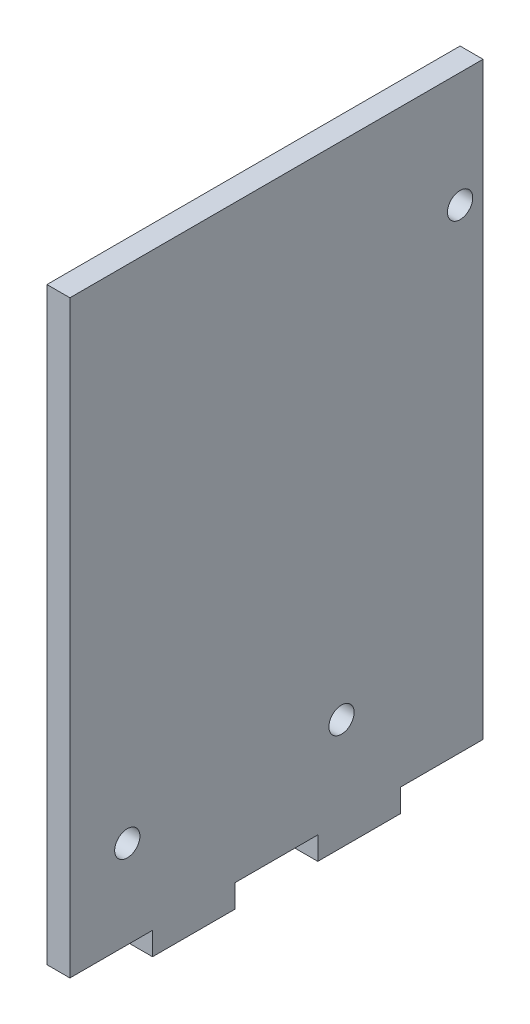
ISO-10303-21;
HEADER;
FILE_DESCRIPTION(('STEP AP214'),'2;1');
FILE_NAME('part.step','',(''),(''),'','','');
FILE_SCHEMA(('AUTOMOTIVE_DESIGN { 1 0 10303 214 1 1 1 1 }'));
ENDSEC;
DATA;
#1=APPLICATION_CONTEXT('core data for automotive mechanical design processes');
#2=APPLICATION_PROTOCOL_DEFINITION('international standard','automotive_design',2000,#1);
#3=PRODUCT_CONTEXT('',#1,'mechanical');
#4=PRODUCT('Part','Part','',(#3));
#5=PRODUCT_RELATED_PRODUCT_CATEGORY('part','',(#4));
#6=PRODUCT_DEFINITION_FORMATION('','',#4);
#7=PRODUCT_DEFINITION_CONTEXT('part definition',#1,'design');
#8=PRODUCT_DEFINITION('design','',#6,#7);
#9=PRODUCT_DEFINITION_SHAPE('','',#8);
#10=(LENGTH_UNIT() NAMED_UNIT(*) SI_UNIT(.MILLI.,.METRE.));
#11=(NAMED_UNIT(*) PLANE_ANGLE_UNIT() SI_UNIT($,.RADIAN.));
#12=(NAMED_UNIT(*) SI_UNIT($,.STERADIAN.) SOLID_ANGLE_UNIT());
#13=UNCERTAINTY_MEASURE_WITH_UNIT(LENGTH_MEASURE(1.E-05),#10,'distance_accuracy_value','');
#14=(GEOMETRIC_REPRESENTATION_CONTEXT(3) GLOBAL_UNCERTAINTY_ASSIGNED_CONTEXT((#13)) GLOBAL_UNIT_ASSIGNED_CONTEXT((#10,
#11,#12)) REPRESENTATION_CONTEXT('',''));
#15=CARTESIAN_POINT('',(0.,0.,0.));
#16=DIRECTION('',(0.,0.,1.));
#17=DIRECTION('',(1.,0.,0.));
#18=AXIS2_PLACEMENT_3D('',#15,#16,#17);
#19=CARTESIAN_POINT('',(3.,40.,0.));
#20=DIRECTION('',(0.,1.,0.));
#21=DIRECTION('',(0.,0.,1.));
#22=AXIS2_PLACEMENT_3D('',#19,#20,#21);
#23=PLANE('',#22);
#24=DIRECTION('',(0.,0.,-1.));
#25=VECTOR('',#24,1.);
#26=CARTESIAN_POINT('',(0.,40.,0.));
#27=LINE('',#26,#25);
#28=CARTESIAN_POINT('',(0.,40.,27.));
#29=VERTEX_POINT('',#28);
#30=CARTESIAN_POINT('',(0.,40.,-27.));
#31=VERTEX_POINT('',#30);
#32=EDGE_CURVE('E190',#29,#31,#27,.T.);
#33=ORIENTED_EDGE('',*,*,#32,.F.);
#34=DIRECTION('',(-1.,0.,0.));
#35=VECTOR('',#34,1.);
#36=CARTESIAN_POINT('',(3.,40.,27.));
#37=LINE('',#36,#35);
#38=CARTESIAN_POINT('',(3.,40.,27.));
#39=VERTEX_POINT('',#38);
#40=EDGE_CURVE('E11',#39,#29,#37,.T.);
#41=ORIENTED_EDGE('',*,*,#40,.F.);
#42=DIRECTION('',(0.,0.,-1.));
#43=VECTOR('',#42,1.);
#44=CARTESIAN_POINT('',(3.,40.,0.));
#45=LINE('',#44,#43);
#46=CARTESIAN_POINT('',(3.,40.,-27.));
#47=VERTEX_POINT('',#46);
#48=EDGE_CURVE('E294',#39,#47,#45,.T.);
#49=ORIENTED_EDGE('',*,*,#48,.T.);
#50=DIRECTION('',(-1.,0.,0.));
#51=VECTOR('',#50,1.);
#52=CARTESIAN_POINT('',(3.,40.,-27.));
#53=LINE('',#52,#51);
#54=EDGE_CURVE('E98',#47,#31,#53,.T.);
#55=ORIENTED_EDGE('',*,*,#54,.T.);
#56=EDGE_LOOP('',(#33,#41,#49,#55));
#57=FACE_BOUND('',#56,.T.);
#58=ADVANCED_FACE('F35',(#57),#23,.T.);
#59=CARTESIAN_POINT('',(3.,0.,27.));
#60=DIRECTION('',(0.,0.,1.));
#61=DIRECTION('',(1.,0.,0.));
#62=AXIS2_PLACEMENT_3D('',#59,#60,#61);
#63=PLANE('',#62);
#64=DIRECTION('',(0.,1.,0.));
#65=VECTOR('',#64,1.);
#66=CARTESIAN_POINT('',(0.,0.,27.));
#67=LINE('',#66,#65);
#68=CARTESIAN_POINT('',(0.,-37.,27.));
#69=VERTEX_POINT('',#68);
#70=EDGE_CURVE('E184',#69,#29,#67,.T.);
#71=ORIENTED_EDGE('',*,*,#70,.F.);
#72=DIRECTION('',(-1.,0.,0.));
#73=VECTOR('',#72,1.);
#74=CARTESIAN_POINT('',(3.,-37.,27.));
#75=LINE('',#74,#73);
#76=CARTESIAN_POINT('',(3.,-37.,27.));
#77=VERTEX_POINT('',#76);
#78=EDGE_CURVE('E44',#77,#69,#75,.T.);
#79=ORIENTED_EDGE('',*,*,#78,.F.);
#80=DIRECTION('',(0.,1.,0.));
#81=VECTOR('',#80,1.);
#82=CARTESIAN_POINT('',(3.,0.,27.));
#83=LINE('',#82,#81);
#84=EDGE_CURVE('E296',#77,#39,#83,.T.);
#85=ORIENTED_EDGE('',*,*,#84,.T.);
#86=ORIENTED_EDGE('',*,*,#40,.T.);
#87=EDGE_LOOP('',(#71,#79,#85,#86));
#88=FACE_BOUND('',#87,.T.);
#89=ADVANCED_FACE('F189',(#88),#63,.T.);
#90=CARTESIAN_POINT('',(3.,-37.,0.));
#91=DIRECTION('',(0.,1.,0.));
#92=DIRECTION('',(0.,0.,1.));
#93=AXIS2_PLACEMENT_3D('',#90,#91,#92);
#94=PLANE('',#93);
#95=DIRECTION('',(0.,0.,-1.));
#96=VECTOR('',#95,1.);
#97=CARTESIAN_POINT('',(0.,-37.,0.));
#98=LINE('',#97,#96);
#99=CARTESIAN_POINT('',(0.,-37.,16.2));
#100=VERTEX_POINT('',#99);
#101=EDGE_CURVE('E175',#69,#100,#98,.T.);
#102=ORIENTED_EDGE('',*,*,#101,.T.);
#103=DIRECTION('',(-1.,0.,0.));
#104=VECTOR('',#103,1.);
#105=CARTESIAN_POINT('',(3.,-37.,16.2));
#106=LINE('',#105,#104);
#107=CARTESIAN_POINT('',(3.,-37.,16.2));
#108=VERTEX_POINT('',#107);
#109=EDGE_CURVE('E168',#108,#100,#106,.T.);
#110=ORIENTED_EDGE('',*,*,#109,.F.);
#111=DIRECTION('',(0.,0.,-1.));
#112=VECTOR('',#111,1.);
#113=CARTESIAN_POINT('',(3.,-37.,0.));
#114=LINE('',#113,#112);
#115=EDGE_CURVE('E177',#77,#108,#114,.T.);
#116=ORIENTED_EDGE('',*,*,#115,.F.);
#117=ORIENTED_EDGE('',*,*,#78,.T.);
#118=EDGE_LOOP('',(#102,#110,#116,#117));
#119=FACE_BOUND('',#118,.T.);
#120=ADVANCED_FACE('F173',(#119),#94,.F.);
#121=CARTESIAN_POINT('',(3.,0.,16.2));
#122=DIRECTION('',(0.,0.,1.));
#123=DIRECTION('',(1.,0.,0.));
#124=AXIS2_PLACEMENT_3D('',#121,#122,#123);
#125=PLANE('',#124);
#126=DIRECTION('',(0.,1.,0.));
#127=VECTOR('',#126,1.);
#128=CARTESIAN_POINT('',(0.,0.,16.2));
#129=LINE('',#128,#127);
#130=CARTESIAN_POINT('',(0.,-40.,16.2));
#131=VERTEX_POINT('',#130);
#132=EDGE_CURVE('E187',#131,#100,#129,.T.);
#133=ORIENTED_EDGE('',*,*,#132,.F.);
#134=DIRECTION('',(-1.,0.,0.));
#135=VECTOR('',#134,1.);
#136=CARTESIAN_POINT('',(3.,-40.,16.2));
#137=LINE('',#136,#135);
#138=CARTESIAN_POINT('',(3.,-40.,16.2));
#139=VERTEX_POINT('',#138);
#140=EDGE_CURVE('E166',#139,#131,#137,.T.);
#141=ORIENTED_EDGE('',*,*,#140,.F.);
#142=DIRECTION('',(0.,1.,0.));
#143=VECTOR('',#142,1.);
#144=CARTESIAN_POINT('',(3.,0.,16.2));
#145=LINE('',#144,#143);
#146=EDGE_CURVE('E303',#139,#108,#145,.T.);
#147=ORIENTED_EDGE('',*,*,#146,.T.);
#148=ORIENTED_EDGE('',*,*,#109,.T.);
#149=EDGE_LOOP('',(#133,#141,#147,#148));
#150=FACE_BOUND('',#149,.T.);
#151=ADVANCED_FACE('F248',(#150),#125,.T.);
#152=CARTESIAN_POINT('',(3.,-40.,0.));
#153=DIRECTION('',(0.,1.,0.));
#154=DIRECTION('',(0.,0.,1.));
#155=AXIS2_PLACEMENT_3D('',#152,#153,#154);
#156=PLANE('',#155);
#157=DIRECTION('',(0.,0.,-1.));
#158=VECTOR('',#157,1.);
#159=CARTESIAN_POINT('',(0.,-40.,0.));
#160=LINE('',#159,#158);
#161=CARTESIAN_POINT('',(0.,-40.,5.4));
#162=VERTEX_POINT('',#161);
#163=EDGE_CURVE('E197',#131,#162,#160,.T.);
#164=ORIENTED_EDGE('',*,*,#163,.T.);
#165=DIRECTION('',(-1.,0.,0.));
#166=VECTOR('',#165,1.);
#167=CARTESIAN_POINT('',(3.,-40.,5.4));
#168=LINE('',#167,#166);
#169=CARTESIAN_POINT('',(3.,-40.,5.4));
#170=VERTEX_POINT('',#169);
#171=EDGE_CURVE('E163',#170,#162,#168,.T.);
#172=ORIENTED_EDGE('',*,*,#171,.F.);
#173=DIRECTION('',(0.,0.,-1.));
#174=VECTOR('',#173,1.);
#175=CARTESIAN_POINT('',(3.,-40.,0.));
#176=LINE('',#175,#174);
#177=EDGE_CURVE('E306',#139,#170,#176,.T.);
#178=ORIENTED_EDGE('',*,*,#177,.F.);
#179=ORIENTED_EDGE('',*,*,#140,.T.);
#180=EDGE_LOOP('',(#164,#172,#178,#179));
#181=FACE_BOUND('',#180,.T.);
#182=ADVANCED_FACE('F251',(#181),#156,.F.);
#183=CARTESIAN_POINT('',(3.,0.,5.4));
#184=DIRECTION('',(0.,0.,1.));
#185=DIRECTION('',(1.,0.,0.));
#186=AXIS2_PLACEMENT_3D('',#183,#184,#185);
#187=PLANE('',#186);
#188=DIRECTION('',(0.,1.,0.));
#189=VECTOR('',#188,1.);
#190=CARTESIAN_POINT('',(0.,0.,5.4));
#191=LINE('',#190,#189);
#192=CARTESIAN_POINT('',(0.,-37.,5.4));
#193=VERTEX_POINT('',#192);
#194=EDGE_CURVE('E200',#162,#193,#191,.T.);
#195=ORIENTED_EDGE('',*,*,#194,.T.);
#196=DIRECTION('',(-1.,0.,0.));
#197=VECTOR('',#196,1.);
#198=CARTESIAN_POINT('',(3.,-37.,5.4));
#199=LINE('',#198,#197);
#200=CARTESIAN_POINT('',(3.,-37.,5.4));
#201=VERTEX_POINT('',#200);
#202=EDGE_CURVE('E160',#201,#193,#199,.T.);
#203=ORIENTED_EDGE('',*,*,#202,.F.);
#204=DIRECTION('',(0.,1.,0.));
#205=VECTOR('',#204,1.);
#206=CARTESIAN_POINT('',(3.,0.,5.4));
#207=LINE('',#206,#205);
#208=EDGE_CURVE('E309',#170,#201,#207,.T.);
#209=ORIENTED_EDGE('',*,*,#208,.F.);
#210=ORIENTED_EDGE('',*,*,#171,.T.);
#211=EDGE_LOOP('',(#195,#203,#209,#210));
#212=FACE_BOUND('',#211,.T.);
#213=ADVANCED_FACE('F255',(#212),#187,.F.);
#214=CARTESIAN_POINT('',(3.,-37.,0.));
#215=DIRECTION('',(0.,1.,0.));
#216=DIRECTION('',(0.,0.,1.));
#217=AXIS2_PLACEMENT_3D('',#214,#215,#216);
#218=PLANE('',#217);
#219=DIRECTION('',(0.,0.,-1.));
#220=VECTOR('',#219,1.);
#221=CARTESIAN_POINT('',(0.,-37.,0.));
#222=LINE('',#221,#220);
#223=CARTESIAN_POINT('',(0.,-37.,-5.4));
#224=VERTEX_POINT('',#223);
#225=EDGE_CURVE('E203',#193,#224,#222,.T.);
#226=ORIENTED_EDGE('',*,*,#225,.T.);
#227=DIRECTION('',(-1.,0.,0.));
#228=VECTOR('',#227,1.);
#229=CARTESIAN_POINT('',(3.,-37.,-5.4));
#230=LINE('',#229,#228);
#231=CARTESIAN_POINT('',(3.,-37.,-5.4));
#232=VERTEX_POINT('',#231);
#233=EDGE_CURVE('E158',#232,#224,#230,.T.);
#234=ORIENTED_EDGE('',*,*,#233,.F.);
#235=DIRECTION('',(0.,0.,-1.));
#236=VECTOR('',#235,1.);
#237=CARTESIAN_POINT('',(3.,-37.,0.));
#238=LINE('',#237,#236);
#239=EDGE_CURVE('E312',#201,#232,#238,.T.);
#240=ORIENTED_EDGE('',*,*,#239,.F.);
#241=ORIENTED_EDGE('',*,*,#202,.T.);
#242=EDGE_LOOP('',(#226,#234,#240,#241));
#243=FACE_BOUND('',#242,.T.);
#244=ADVANCED_FACE('F259',(#243),#218,.F.);
#245=CARTESIAN_POINT('',(3.,0.,-5.39999999999998));
#246=DIRECTION('',(0.,0.,1.));
#247=DIRECTION('',(0.,-1.,0.));
#248=AXIS2_PLACEMENT_3D('',#245,#246,#247);
#249=PLANE('',#248);
#250=DIRECTION('',(0.,1.,0.));
#251=VECTOR('',#250,1.);
#252=CARTESIAN_POINT('',(0.,0.,-5.39999999999998));
#253=LINE('',#252,#251);
#254=CARTESIAN_POINT('',(0.,-40.,-5.40000000000001));
#255=VERTEX_POINT('',#254);
#256=EDGE_CURVE('E206',#255,#224,#253,.T.);
#257=ORIENTED_EDGE('',*,*,#256,.F.);
#258=DIRECTION('',(-1.,0.,0.));
#259=VECTOR('',#258,1.);
#260=CARTESIAN_POINT('',(3.,-40.,-5.40000000000001));
#261=LINE('',#260,#259);
#262=CARTESIAN_POINT('',(3.,-40.,-5.40000000000001));
#263=VERTEX_POINT('',#262);
#264=EDGE_CURVE('E152',#263,#255,#261,.T.);
#265=ORIENTED_EDGE('',*,*,#264,.F.);
#266=DIRECTION('',(0.,1.,0.));
#267=VECTOR('',#266,1.);
#268=CARTESIAN_POINT('',(3.,0.,-5.39999999999998));
#269=LINE('',#268,#267);
#270=EDGE_CURVE('E314',#263,#232,#269,.T.);
#271=ORIENTED_EDGE('',*,*,#270,.T.);
#272=ORIENTED_EDGE('',*,*,#233,.T.);
#273=EDGE_LOOP('',(#257,#265,#271,#272));
#274=FACE_BOUND('',#273,.T.);
#275=ADVANCED_FACE('F263',(#274),#249,.T.);
#276=CARTESIAN_POINT('',(3.,-40.,0.));
#277=DIRECTION('',(0.,-1.,0.));
#278=DIRECTION('',(0.,0.,-1.));
#279=AXIS2_PLACEMENT_3D('',#276,#277,#278);
#280=PLANE('',#279);
#281=DIRECTION('',(0.,0.,1.));
#282=VECTOR('',#281,1.);
#283=CARTESIAN_POINT('',(0.,-40.,0.));
#284=LINE('',#283,#282);
#285=CARTESIAN_POINT('',(0.,-40.,-16.2));
#286=VERTEX_POINT('',#285);
#287=EDGE_CURVE('E209',#286,#255,#284,.T.);
#288=ORIENTED_EDGE('',*,*,#287,.F.);
#289=DIRECTION('',(-1.,0.,0.));
#290=VECTOR('',#289,1.);
#291=CARTESIAN_POINT('',(3.,-40.,-16.2));
#292=LINE('',#291,#290);
#293=CARTESIAN_POINT('',(3.,-40.,-16.2));
#294=VERTEX_POINT('',#293);
#295=EDGE_CURVE('E150',#294,#286,#292,.T.);
#296=ORIENTED_EDGE('',*,*,#295,.F.);
#297=DIRECTION('',(0.,0.,1.));
#298=VECTOR('',#297,1.);
#299=CARTESIAN_POINT('',(3.,-40.,0.));
#300=LINE('',#299,#298);
#301=EDGE_CURVE('E144',#294,#263,#300,.T.);
#302=ORIENTED_EDGE('',*,*,#301,.T.);
#303=ORIENTED_EDGE('',*,*,#264,.T.);
#304=EDGE_LOOP('',(#288,#296,#302,#303));
#305=FACE_BOUND('',#304,.T.);
#306=ADVANCED_FACE('F267',(#305),#280,.T.);
#307=CARTESIAN_POINT('',(3.,0.,-16.2));
#308=DIRECTION('',(0.,0.,1.));
#309=DIRECTION('',(1.,0.,0.));
#310=AXIS2_PLACEMENT_3D('',#307,#308,#309);
#311=PLANE('',#310);
#312=DIRECTION('',(0.,1.,0.));
#313=VECTOR('',#312,1.);
#314=CARTESIAN_POINT('',(0.,0.,-16.2));
#315=LINE('',#314,#313);
#316=CARTESIAN_POINT('',(0.,-37.,-16.2));
#317=VERTEX_POINT('',#316);
#318=EDGE_CURVE('E149',#286,#317,#315,.T.);
#319=ORIENTED_EDGE('',*,*,#318,.T.);
#320=DIRECTION('',(-1.,0.,0.));
#321=VECTOR('',#320,1.);
#322=CARTESIAN_POINT('',(3.,-37.,-16.2));
#323=LINE('',#322,#321);
#324=CARTESIAN_POINT('',(3.,-37.,-16.2));
#325=VERTEX_POINT('',#324);
#326=EDGE_CURVE('E134',#325,#317,#323,.T.);
#327=ORIENTED_EDGE('',*,*,#326,.F.);
#328=DIRECTION('',(0.,1.,0.));
#329=VECTOR('',#328,1.);
#330=CARTESIAN_POINT('',(3.,0.,-16.2));
#331=LINE('',#330,#329);
#332=EDGE_CURVE('E137',#294,#325,#331,.T.);
#333=ORIENTED_EDGE('',*,*,#332,.F.);
#334=ORIENTED_EDGE('',*,*,#295,.T.);
#335=EDGE_LOOP('',(#319,#327,#333,#334));
#336=FACE_BOUND('',#335,.T.);
#337=ADVANCED_FACE('F147',(#336),#311,.F.);
#338=CARTESIAN_POINT('',(3.,-37.,0.));
#339=DIRECTION('',(0.,1.,0.));
#340=DIRECTION('',(0.,0.,1.));
#341=AXIS2_PLACEMENT_3D('',#338,#339,#340);
#342=PLANE('',#341);
#343=DIRECTION('',(0.,0.,-1.));
#344=VECTOR('',#343,1.);
#345=CARTESIAN_POINT('',(0.,-37.,0.));
#346=LINE('',#345,#344);
#347=CARTESIAN_POINT('',(0.,-37.,-27.));
#348=VERTEX_POINT('',#347);
#349=EDGE_CURVE('E213',#317,#348,#346,.T.);
#350=ORIENTED_EDGE('',*,*,#349,.T.);
#351=DIRECTION('',(-1.,0.,0.));
#352=VECTOR('',#351,1.);
#353=CARTESIAN_POINT('',(3.,-37.,-27.));
#354=LINE('',#353,#352);
#355=CARTESIAN_POINT('',(3.,-37.,-27.));
#356=VERTEX_POINT('',#355);
#357=EDGE_CURVE('E136',#356,#348,#354,.T.);
#358=ORIENTED_EDGE('',*,*,#357,.F.);
#359=DIRECTION('',(0.,0.,-1.));
#360=VECTOR('',#359,1.);
#361=CARTESIAN_POINT('',(3.,-37.,0.));
#362=LINE('',#361,#360);
#363=EDGE_CURVE('E129',#325,#356,#362,.T.);
#364=ORIENTED_EDGE('',*,*,#363,.F.);
#365=ORIENTED_EDGE('',*,*,#326,.T.);
#366=EDGE_LOOP('',(#350,#358,#364,#365));
#367=FACE_BOUND('',#366,.T.);
#368=ADVANCED_FACE('F132',(#367),#342,.F.);
#369=CARTESIAN_POINT('',(3.,25.,-24.));
#370=DIRECTION('',(-1.,0.,0.));
#371=DIRECTION('',(0.,0.,1.));
#372=AXIS2_PLACEMENT_3D('',#369,#370,#371);
#373=CYLINDRICAL_SURFACE('',#372,1.65);
#374=CARTESIAN_POINT('',(3.,25.,-24.));
#375=DIRECTION('',(1.,0.,0.));
#376=DIRECTION('',(0.,0.,-1.));
#377=AXIS2_PLACEMENT_3D('',#374,#375,#376);
#378=CIRCLE('',#377,1.65);
#379=CARTESIAN_POINT('',(3.,25.,-25.65));
#380=VERTEX_POINT('',#379);
#381=EDGE_CURVE('E293',#380,#380,#378,.T.);
#382=ORIENTED_EDGE('',*,*,#381,.T.);
#383=EDGE_LOOP('',(#382));
#384=FACE_BOUND('',#383,.T.);
#385=CARTESIAN_POINT('',(0.,25.,-24.));
#386=DIRECTION('',(1.,0.,0.));
#387=DIRECTION('',(0.,0.,-1.));
#388=AXIS2_PLACEMENT_3D('',#385,#386,#387);
#389=CIRCLE('',#388,1.65);
#390=CARTESIAN_POINT('',(0.,25.,-25.65));
#391=VERTEX_POINT('',#390);
#392=EDGE_CURVE('E192',#391,#391,#389,.T.);
#393=ORIENTED_EDGE('',*,*,#392,.F.);
#394=EDGE_LOOP('',(#393));
#395=FACE_BOUND('',#394,.T.);
#396=ADVANCED_FACE('F227',(#384,#395),#373,.F.);
#397=CARTESIAN_POINT('',(3.,-25.5,19.5));
#398=DIRECTION('',(-1.,0.,0.));
#399=DIRECTION('',(0.,0.,1.));
#400=AXIS2_PLACEMENT_3D('',#397,#398,#399);
#401=CYLINDRICAL_SURFACE('',#400,1.65);
#402=CARTESIAN_POINT('',(3.,-25.5,19.5));
#403=DIRECTION('',(1.,0.,0.));
#404=DIRECTION('',(0.,0.,-1.));
#405=AXIS2_PLACEMENT_3D('',#402,#403,#404);
#406=CIRCLE('',#405,1.65);
#407=CARTESIAN_POINT('',(3.,-25.5,17.85));
#408=VERTEX_POINT('',#407);
#409=EDGE_CURVE('E291',#408,#408,#406,.T.);
#410=ORIENTED_EDGE('',*,*,#409,.T.);
#411=EDGE_LOOP('',(#410));
#412=FACE_BOUND('',#411,.T.);
#413=CARTESIAN_POINT('',(0.,-25.5,19.5));
#414=DIRECTION('',(1.,0.,0.));
#415=DIRECTION('',(0.,0.,-1.));
#416=AXIS2_PLACEMENT_3D('',#413,#414,#415);
#417=CIRCLE('',#416,1.65);
#418=CARTESIAN_POINT('',(0.,-25.5,17.85));
#419=VERTEX_POINT('',#418);
#420=EDGE_CURVE('E221',#419,#419,#417,.T.);
#421=ORIENTED_EDGE('',*,*,#420,.F.);
#422=EDGE_LOOP('',(#421));
#423=FACE_BOUND('',#422,.T.);
#424=ADVANCED_FACE('F229',(#412,#423),#401,.F.);
#425=CARTESIAN_POINT('',(3.,-25.5,-8.49999999999999));
#426=DIRECTION('',(-1.,0.,0.));
#427=DIRECTION('',(0.,0.,1.));
#428=AXIS2_PLACEMENT_3D('',#425,#426,#427);
#429=CYLINDRICAL_SURFACE('',#428,1.65);
#430=CARTESIAN_POINT('',(3.,-25.5,-8.49999999999999));
#431=DIRECTION('',(1.,0.,0.));
#432=DIRECTION('',(0.,0.,-1.));
#433=AXIS2_PLACEMENT_3D('',#430,#431,#432);
#434=CIRCLE('',#433,1.65);
#435=CARTESIAN_POINT('',(3.,-25.5,-10.15));
#436=VERTEX_POINT('',#435);
#437=EDGE_CURVE('E215',#436,#436,#434,.T.);
#438=ORIENTED_EDGE('',*,*,#437,.T.);
#439=EDGE_LOOP('',(#438));
#440=FACE_BOUND('',#439,.T.);
#441=CARTESIAN_POINT('',(0.,-25.5,-8.49999999999999));
#442=DIRECTION('',(1.,0.,0.));
#443=DIRECTION('',(0.,0.,-1.));
#444=AXIS2_PLACEMENT_3D('',#441,#442,#443);
#445=CIRCLE('',#444,1.65);
#446=CARTESIAN_POINT('',(0.,-25.5,-10.15));
#447=VERTEX_POINT('',#446);
#448=EDGE_CURVE('E218',#447,#447,#445,.T.);
#449=ORIENTED_EDGE('',*,*,#448,.F.);
#450=EDGE_LOOP('',(#449));
#451=FACE_BOUND('',#450,.T.);
#452=ADVANCED_FACE('F37',(#440,#451),#429,.F.);
#453=CARTESIAN_POINT('',(3.,0.,-27.));
#454=DIRECTION('',(0.,0.,1.));
#455=DIRECTION('',(0.,-1.,0.));
#456=AXIS2_PLACEMENT_3D('',#453,#454,#455);
#457=PLANE('',#456);
#458=DIRECTION('',(0.,1.,0.));
#459=VECTOR('',#458,1.);
#460=CARTESIAN_POINT('',(0.,0.,-27.));
#461=LINE('',#460,#459);
#462=EDGE_CURVE('E91',#348,#31,#461,.T.);
#463=ORIENTED_EDGE('',*,*,#462,.T.);
#464=ORIENTED_EDGE('',*,*,#54,.F.);
#465=DIRECTION('',(0.,1.,0.));
#466=VECTOR('',#465,1.);
#467=CARTESIAN_POINT('',(3.,0.,-27.));
#468=LINE('',#467,#466);
#469=EDGE_CURVE('E52',#356,#47,#468,.T.);
#470=ORIENTED_EDGE('',*,*,#469,.F.);
#471=ORIENTED_EDGE('',*,*,#357,.T.);
#472=EDGE_LOOP('',(#463,#464,#470,#471));
#473=FACE_BOUND('',#472,.T.);
#474=ADVANCED_FACE('F274',(#473),#457,.F.);
#475=CARTESIAN_POINT('',(3.,0.,0.));
#476=DIRECTION('',(1.,0.,0.));
#477=DIRECTION('',(0.,0.,-1.));
#478=AXIS2_PLACEMENT_3D('',#475,#476,#477);
#479=PLANE('',#478);
#480=ORIENTED_EDGE('',*,*,#437,.F.);
#481=EDGE_LOOP('',(#480));
#482=FACE_BOUND('',#481,.T.);
#483=ORIENTED_EDGE('',*,*,#409,.F.);
#484=EDGE_LOOP('',(#483));
#485=FACE_BOUND('',#484,.T.);
#486=ORIENTED_EDGE('',*,*,#381,.F.);
#487=EDGE_LOOP('',(#486));
#488=FACE_BOUND('',#487,.T.);
#489=ORIENTED_EDGE('',*,*,#48,.F.);
#490=ORIENTED_EDGE('',*,*,#84,.F.);
#491=ORIENTED_EDGE('',*,*,#115,.T.);
#492=ORIENTED_EDGE('',*,*,#146,.F.);
#493=ORIENTED_EDGE('',*,*,#177,.T.);
#494=ORIENTED_EDGE('',*,*,#208,.T.);
#495=ORIENTED_EDGE('',*,*,#239,.T.);
#496=ORIENTED_EDGE('',*,*,#270,.F.);
#497=ORIENTED_EDGE('',*,*,#301,.F.);
#498=ORIENTED_EDGE('',*,*,#332,.T.);
#499=ORIENTED_EDGE('',*,*,#363,.T.);
#500=ORIENTED_EDGE('',*,*,#469,.T.);
#501=EDGE_LOOP('',(#489,#490,#491,#492,#493,#494,#495,#496,#497,#498,#499,#500));
#502=FACE_BOUND('',#501,.T.);
#503=ADVANCED_FACE('F141',(#482,#485,#488,#502),#479,.T.);
#504=CARTESIAN_POINT('',(0.,0.,0.));
#505=DIRECTION('',(1.,0.,0.));
#506=DIRECTION('',(0.,0.,-1.));
#507=AXIS2_PLACEMENT_3D('',#504,#505,#506);
#508=PLANE('',#507);
#509=ORIENTED_EDGE('',*,*,#448,.T.);
#510=EDGE_LOOP('',(#509));
#511=FACE_BOUND('',#510,.T.);
#512=ORIENTED_EDGE('',*,*,#420,.T.);
#513=EDGE_LOOP('',(#512));
#514=FACE_BOUND('',#513,.T.);
#515=ORIENTED_EDGE('',*,*,#392,.T.);
#516=EDGE_LOOP('',(#515));
#517=FACE_BOUND('',#516,.T.);
#518=ORIENTED_EDGE('',*,*,#32,.T.);
#519=ORIENTED_EDGE('',*,*,#462,.F.);
#520=ORIENTED_EDGE('',*,*,#349,.F.);
#521=ORIENTED_EDGE('',*,*,#318,.F.);
#522=ORIENTED_EDGE('',*,*,#287,.T.);
#523=ORIENTED_EDGE('',*,*,#256,.T.);
#524=ORIENTED_EDGE('',*,*,#225,.F.);
#525=ORIENTED_EDGE('',*,*,#194,.F.);
#526=ORIENTED_EDGE('',*,*,#163,.F.);
#527=ORIENTED_EDGE('',*,*,#132,.T.);
#528=ORIENTED_EDGE('',*,*,#101,.F.);
#529=ORIENTED_EDGE('',*,*,#70,.T.);
#530=EDGE_LOOP('',(#518,#519,#520,#521,#522,#523,#524,#525,#526,#527,#528,#529));
#531=FACE_BOUND('',#530,.T.);
#532=ADVANCED_FACE('F183',(#511,#514,#517,#531),#508,.F.);
#533=CLOSED_SHELL('',(#58,#89,#120,#151,#182,#213,#244,#275,#306,#337,#368,#396,#424,#452,#474,
#503,#532));
#534=MANIFOLD_SOLID_BREP('B2',#533);
#535=ADVANCED_BREP_SHAPE_REPRESENTATION('',(#18,#534),#14);
#536=SHAPE_DEFINITION_REPRESENTATION(#9,#535);
ENDSEC;
END-ISO-10303-21;
